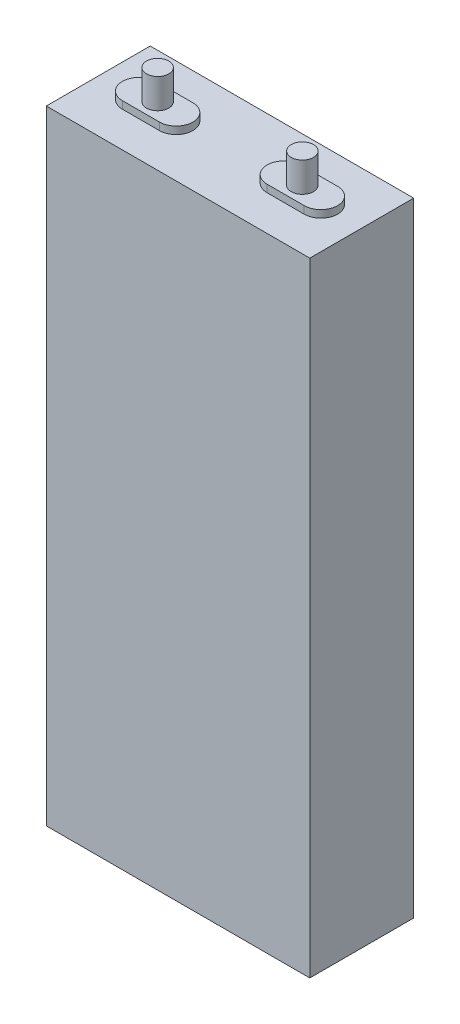
ISO-10303-21;
HEADER;
FILE_DESCRIPTION(('STEP AP214'),'2;1');
FILE_NAME('part.step','',(''),(''),'','','');
FILE_SCHEMA(('AUTOMOTIVE_DESIGN { 1 0 10303 214 1 1 1 1 }'));
ENDSEC;
DATA;
#1=APPLICATION_CONTEXT('core data for automotive mechanical design processes');
#2=APPLICATION_PROTOCOL_DEFINITION('international standard','automotive_design',2000,#1);
#3=PRODUCT_CONTEXT('',#1,'mechanical');
#4=PRODUCT('Part','Part','',(#3));
#5=PRODUCT_RELATED_PRODUCT_CATEGORY('part','',(#4));
#6=PRODUCT_DEFINITION_FORMATION('','',#4);
#7=PRODUCT_DEFINITION_CONTEXT('part definition',#1,'design');
#8=PRODUCT_DEFINITION('design','',#6,#7);
#9=PRODUCT_DEFINITION_SHAPE('','',#8);
#10=(LENGTH_UNIT() NAMED_UNIT(*) SI_UNIT(.MILLI.,.METRE.));
#11=(NAMED_UNIT(*) PLANE_ANGLE_UNIT() SI_UNIT($,.RADIAN.));
#12=(NAMED_UNIT(*) SI_UNIT($,.STERADIAN.) SOLID_ANGLE_UNIT());
#13=UNCERTAINTY_MEASURE_WITH_UNIT(LENGTH_MEASURE(1.E-05),#10,'distance_accuracy_value','');
#14=(GEOMETRIC_REPRESENTATION_CONTEXT(3) GLOBAL_UNCERTAINTY_ASSIGNED_CONTEXT((#13)) GLOBAL_UNIT_ASSIGNED_CONTEXT((#10,
#11,#12)) REPRESENTATION_CONTEXT('',''));
#15=CARTESIAN_POINT('',(0.,0.,0.));
#16=DIRECTION('',(0.,0.,1.));
#17=DIRECTION('',(1.,0.,0.));
#18=AXIS2_PLACEMENT_3D('',#15,#16,#17);
#19=CARTESIAN_POINT('',(0.,168.,0.));
#20=DIRECTION('',(0.,1.,0.));
#21=DIRECTION('',(0.,0.,1.));
#22=AXIS2_PLACEMENT_3D('',#19,#20,#21);
#23=PLANE('',#22);
#24=DIRECTION('',(0.,0.,1.));
#25=VECTOR('',#24,1.);
#26=CARTESIAN_POINT('',(-35.5,168.,-14.));
#27=LINE('',#26,#25);
#28=CARTESIAN_POINT('',(-35.5,168.,-14.));
#29=VERTEX_POINT('',#28);
#30=CARTESIAN_POINT('',(-35.5,168.,14.));
#31=VERTEX_POINT('',#30);
#32=EDGE_CURVE('E180',#29,#31,#27,.T.);
#33=ORIENTED_EDGE('',*,*,#32,.T.);
#34=DIRECTION('',(1.,0.,0.));
#35=VECTOR('',#34,1.);
#36=CARTESIAN_POINT('',(-35.5,168.,14.));
#37=LINE('',#36,#35);
#38=CARTESIAN_POINT('',(35.5,168.,14.));
#39=VERTEX_POINT('',#38);
#40=EDGE_CURVE('E183',#31,#39,#37,.T.);
#41=ORIENTED_EDGE('',*,*,#40,.T.);
#42=DIRECTION('',(0.,0.,-1.));
#43=VECTOR('',#42,1.);
#44=CARTESIAN_POINT('',(35.5,168.,-14.));
#45=LINE('',#44,#43);
#46=CARTESIAN_POINT('',(35.5,168.,-14.));
#47=VERTEX_POINT('',#46);
#48=EDGE_CURVE('E186',#39,#47,#45,.T.);
#49=ORIENTED_EDGE('',*,*,#48,.T.);
#50=DIRECTION('',(-1.,0.,0.));
#51=VECTOR('',#50,1.);
#52=CARTESIAN_POINT('',(-35.5,168.,-14.));
#53=LINE('',#52,#51);
#54=EDGE_CURVE('E188',#47,#29,#53,.T.);
#55=ORIENTED_EDGE('',*,*,#54,.T.);
#56=EDGE_LOOP('',(#33,#41,#49,#55));
#57=FACE_BOUND('',#56,.T.);
#58=DIRECTION('',(1.,0.,0.));
#59=VECTOR('',#58,1.);
#60=CARTESIAN_POINT('',(-24.5,168.,4.5));
#61=LINE('',#60,#59);
#62=CARTESIAN_POINT('',(-24.5,168.,4.5));
#63=VERTEX_POINT('',#62);
#64=CARTESIAN_POINT('',(-14.5,168.,4.5));
#65=VERTEX_POINT('',#64);
#66=EDGE_CURVE('E151',#63,#65,#61,.T.);
#67=ORIENTED_EDGE('',*,*,#66,.F.);
#68=CARTESIAN_POINT('',(-24.5,168.,0.));
#69=DIRECTION('',(0.,1.,0.));
#70=DIRECTION('',(0.,0.,1.));
#71=AXIS2_PLACEMENT_3D('',#68,#69,#70);
#72=CIRCLE('',#71,4.5);
#73=CARTESIAN_POINT('',(-24.5,168.,-4.5));
#74=VERTEX_POINT('',#73);
#75=EDGE_CURVE('E148',#74,#63,#72,.T.);
#76=ORIENTED_EDGE('',*,*,#75,.F.);
#77=DIRECTION('',(-1.,0.,0.));
#78=VECTOR('',#77,1.);
#79=CARTESIAN_POINT('',(-24.5,168.,-4.5));
#80=LINE('',#79,#78);
#81=CARTESIAN_POINT('',(-14.5,168.,-4.5));
#82=VERTEX_POINT('',#81);
#83=EDGE_CURVE('E160',#82,#74,#80,.T.);
#84=ORIENTED_EDGE('',*,*,#83,.F.);
#85=CARTESIAN_POINT('',(-14.5,168.,0.));
#86=DIRECTION('',(0.,1.,0.));
#87=DIRECTION('',(0.,0.,1.));
#88=AXIS2_PLACEMENT_3D('',#85,#86,#87);
#89=CIRCLE('',#88,4.5);
#90=EDGE_CURVE('E168',#65,#82,#89,.T.);
#91=ORIENTED_EDGE('',*,*,#90,.F.);
#92=EDGE_LOOP('',(#67,#76,#84,#91));
#93=FACE_BOUND('',#92,.T.);
#94=DIRECTION('',(-1.,0.,0.));
#95=VECTOR('',#94,1.);
#96=CARTESIAN_POINT('',(24.5,168.,-4.5));
#97=LINE('',#96,#95);
#98=CARTESIAN_POINT('',(24.5,168.,-4.5));
#99=VERTEX_POINT('',#98);
#100=CARTESIAN_POINT('',(14.5,168.,-4.5));
#101=VERTEX_POINT('',#100);
#102=EDGE_CURVE('E234',#99,#101,#97,.T.);
#103=ORIENTED_EDGE('',*,*,#102,.F.);
#104=CARTESIAN_POINT('',(24.5,168.,0.));
#105=DIRECTION('',(0.,1.,0.));
#106=DIRECTION('',(0.,0.,-1.));
#107=AXIS2_PLACEMENT_3D('',#104,#105,#106);
#108=CIRCLE('',#107,4.5);
#109=CARTESIAN_POINT('',(24.5,168.,4.5));
#110=VERTEX_POINT('',#109);
#111=EDGE_CURVE('E146',#110,#99,#108,.T.);
#112=ORIENTED_EDGE('',*,*,#111,.F.);
#113=DIRECTION('',(1.,0.,0.));
#114=VECTOR('',#113,1.);
#115=CARTESIAN_POINT('',(24.5,168.,4.5));
#116=LINE('',#115,#114);
#117=CARTESIAN_POINT('',(14.5,168.,4.5));
#118=VERTEX_POINT('',#117);
#119=EDGE_CURVE('E142',#118,#110,#116,.T.);
#120=ORIENTED_EDGE('',*,*,#119,.F.);
#121=CARTESIAN_POINT('',(14.5,168.,0.));
#122=DIRECTION('',(0.,1.,0.));
#123=DIRECTION('',(0.,0.,-1.));
#124=AXIS2_PLACEMENT_3D('',#121,#122,#123);
#125=CIRCLE('',#124,4.5);
#126=EDGE_CURVE('E236',#101,#118,#125,.T.);
#127=ORIENTED_EDGE('',*,*,#126,.F.);
#128=EDGE_LOOP('',(#103,#112,#120,#127));
#129=FACE_BOUND('',#128,.T.);
#130=ADVANCED_FACE('F33',(#57,#93,#129),#23,.T.);
#131=CARTESIAN_POINT('',(-35.5,168.,-14.));
#132=DIRECTION('',(1.,0.,0.));
#133=DIRECTION('',(0.,0.,-1.));
#134=AXIS2_PLACEMENT_3D('',#131,#132,#133);
#135=PLANE('',#134);
#136=DIRECTION('',(0.,0.,1.));
#137=VECTOR('',#136,1.);
#138=CARTESIAN_POINT('',(-35.5,0.,-14.));
#139=LINE('',#138,#137);
#140=CARTESIAN_POINT('',(-35.5,0.,-14.));
#141=VERTEX_POINT('',#140);
#142=CARTESIAN_POINT('',(-35.5,0.,14.));
#143=VERTEX_POINT('',#142);
#144=EDGE_CURVE('E179',#141,#143,#139,.T.);
#145=ORIENTED_EDGE('',*,*,#144,.T.);
#146=DIRECTION('',(0.,-1.,0.));
#147=VECTOR('',#146,1.);
#148=CARTESIAN_POINT('',(-35.5,168.,14.));
#149=LINE('',#148,#147);
#150=EDGE_CURVE('E41',#31,#143,#149,.T.);
#151=ORIENTED_EDGE('',*,*,#150,.F.);
#152=ORIENTED_EDGE('',*,*,#32,.F.);
#153=DIRECTION('',(0.,-1.,0.));
#154=VECTOR('',#153,1.);
#155=CARTESIAN_POINT('',(-35.5,168.,-14.));
#156=LINE('',#155,#154);
#157=EDGE_CURVE('E190',#29,#141,#156,.T.);
#158=ORIENTED_EDGE('',*,*,#157,.T.);
#159=EDGE_LOOP('',(#145,#151,#152,#158));
#160=FACE_BOUND('',#159,.T.);
#161=ADVANCED_FACE('F35',(#160),#135,.F.);
#162=CARTESIAN_POINT('',(-35.5,168.,14.));
#163=DIRECTION('',(0.,0.,-1.));
#164=DIRECTION('',(-1.,0.,0.));
#165=AXIS2_PLACEMENT_3D('',#162,#163,#164);
#166=PLANE('',#165);
#167=DIRECTION('',(1.,0.,0.));
#168=VECTOR('',#167,1.);
#169=CARTESIAN_POINT('',(-35.5,0.,14.));
#170=LINE('',#169,#168);
#171=CARTESIAN_POINT('',(35.5,0.,14.));
#172=VERTEX_POINT('',#171);
#173=EDGE_CURVE('E193',#143,#172,#170,.T.);
#174=ORIENTED_EDGE('',*,*,#173,.T.);
#175=DIRECTION('',(0.,-1.,0.));
#176=VECTOR('',#175,1.);
#177=CARTESIAN_POINT('',(35.5,168.,14.));
#178=LINE('',#177,#176);
#179=EDGE_CURVE('E203',#39,#172,#178,.T.);
#180=ORIENTED_EDGE('',*,*,#179,.F.);
#181=ORIENTED_EDGE('',*,*,#40,.F.);
#182=ORIENTED_EDGE('',*,*,#150,.T.);
#183=EDGE_LOOP('',(#174,#180,#181,#182));
#184=FACE_BOUND('',#183,.T.);
#185=ADVANCED_FACE('F208',(#184),#166,.F.);
#186=CARTESIAN_POINT('',(35.5,168.,-14.));
#187=DIRECTION('',(-1.,0.,0.));
#188=DIRECTION('',(0.,0.,1.));
#189=AXIS2_PLACEMENT_3D('',#186,#187,#188);
#190=PLANE('',#189);
#191=DIRECTION('',(0.,0.,-1.));
#192=VECTOR('',#191,1.);
#193=CARTESIAN_POINT('',(35.5,0.,-14.));
#194=LINE('',#193,#192);
#195=CARTESIAN_POINT('',(35.5,0.,-14.));
#196=VERTEX_POINT('',#195);
#197=EDGE_CURVE('E195',#172,#196,#194,.T.);
#198=ORIENTED_EDGE('',*,*,#197,.T.);
#199=DIRECTION('',(0.,-1.,0.));
#200=VECTOR('',#199,1.);
#201=CARTESIAN_POINT('',(35.5,168.,-14.));
#202=LINE('',#201,#200);
#203=EDGE_CURVE('E200',#47,#196,#202,.T.);
#204=ORIENTED_EDGE('',*,*,#203,.F.);
#205=ORIENTED_EDGE('',*,*,#48,.F.);
#206=ORIENTED_EDGE('',*,*,#179,.T.);
#207=EDGE_LOOP('',(#198,#204,#205,#206));
#208=FACE_BOUND('',#207,.T.);
#209=ADVANCED_FACE('F220',(#208),#190,.F.);
#210=CARTESIAN_POINT('',(-35.5,168.,-14.));
#211=DIRECTION('',(0.,0.,1.));
#212=DIRECTION('',(1.,0.,0.));
#213=AXIS2_PLACEMENT_3D('',#210,#211,#212);
#214=PLANE('',#213);
#215=DIRECTION('',(-1.,0.,0.));
#216=VECTOR('',#215,1.);
#217=CARTESIAN_POINT('',(-35.5,0.,-14.));
#218=LINE('',#217,#216);
#219=EDGE_CURVE('E184',#196,#141,#218,.T.);
#220=ORIENTED_EDGE('',*,*,#219,.T.);
#221=ORIENTED_EDGE('',*,*,#157,.F.);
#222=ORIENTED_EDGE('',*,*,#54,.F.);
#223=ORIENTED_EDGE('',*,*,#203,.T.);
#224=EDGE_LOOP('',(#220,#221,#222,#223));
#225=FACE_BOUND('',#224,.T.);
#226=ADVANCED_FACE('F224',(#225),#214,.F.);
#227=CARTESIAN_POINT('',(0.,0.,0.));
#228=DIRECTION('',(0.,1.,0.));
#229=DIRECTION('',(0.,0.,1.));
#230=AXIS2_PLACEMENT_3D('',#227,#228,#229);
#231=PLANE('',#230);
#232=ORIENTED_EDGE('',*,*,#144,.F.);
#233=ORIENTED_EDGE('',*,*,#219,.F.);
#234=ORIENTED_EDGE('',*,*,#197,.F.);
#235=ORIENTED_EDGE('',*,*,#173,.F.);
#236=EDGE_LOOP('',(#232,#233,#234,#235));
#237=FACE_BOUND('',#236,.T.);
#238=ADVANCED_FACE('F216',(#237),#231,.F.);
#239=CARTESIAN_POINT('',(-24.5,170.,0.));
#240=DIRECTION('',(0.,-1.,0.));
#241=DIRECTION('',(0.,0.,-1.));
#242=AXIS2_PLACEMENT_3D('',#239,#240,#241);
#243=CYLINDRICAL_SURFACE('',#242,4.5);
#244=ORIENTED_EDGE('',*,*,#75,.T.);
#245=DIRECTION('',(0.,-1.,0.));
#246=VECTOR('',#245,1.);
#247=CARTESIAN_POINT('',(-24.5,170.,4.5));
#248=LINE('',#247,#246);
#249=CARTESIAN_POINT('',(-24.5,170.,4.5));
#250=VERTEX_POINT('',#249);
#251=EDGE_CURVE('E177',#250,#63,#248,.T.);
#252=ORIENTED_EDGE('',*,*,#251,.F.);
#253=CARTESIAN_POINT('',(-24.5,170.,0.));
#254=DIRECTION('',(0.,1.,0.));
#255=DIRECTION('',(0.,0.,1.));
#256=AXIS2_PLACEMENT_3D('',#253,#254,#255);
#257=CIRCLE('',#256,4.5);
#258=CARTESIAN_POINT('',(-24.5,170.,-4.5));
#259=VERTEX_POINT('',#258);
#260=EDGE_CURVE('E156',#259,#250,#257,.T.);
#261=ORIENTED_EDGE('',*,*,#260,.F.);
#262=DIRECTION('',(0.,-1.,0.));
#263=VECTOR('',#262,1.);
#264=CARTESIAN_POINT('',(-24.5,170.,-4.5));
#265=LINE('',#264,#263);
#266=EDGE_CURVE('E165',#259,#74,#265,.T.);
#267=ORIENTED_EDGE('',*,*,#266,.T.);
#268=EDGE_LOOP('',(#244,#252,#261,#267));
#269=FACE_BOUND('',#268,.T.);
#270=ADVANCED_FACE('F300',(#269),#243,.T.);
#271=CARTESIAN_POINT('',(-24.5,170.,4.5));
#272=DIRECTION('',(0.,0.,-1.));
#273=DIRECTION('',(-1.,0.,0.));
#274=AXIS2_PLACEMENT_3D('',#271,#272,#273);
#275=PLANE('',#274);
#276=ORIENTED_EDGE('',*,*,#66,.T.);
#277=DIRECTION('',(0.,-1.,0.));
#278=VECTOR('',#277,1.);
#279=CARTESIAN_POINT('',(-14.5,170.,4.5));
#280=LINE('',#279,#278);
#281=CARTESIAN_POINT('',(-14.5,170.,4.5));
#282=VERTEX_POINT('',#281);
#283=EDGE_CURVE('E174',#282,#65,#280,.T.);
#284=ORIENTED_EDGE('',*,*,#283,.F.);
#285=DIRECTION('',(1.,0.,0.));
#286=VECTOR('',#285,1.);
#287=CARTESIAN_POINT('',(-24.5,170.,4.5));
#288=LINE('',#287,#286);
#289=EDGE_CURVE('E159',#250,#282,#288,.T.);
#290=ORIENTED_EDGE('',*,*,#289,.F.);
#291=ORIENTED_EDGE('',*,*,#251,.T.);
#292=EDGE_LOOP('',(#276,#284,#290,#291));
#293=FACE_BOUND('',#292,.T.);
#294=ADVANCED_FACE('F296',(#293),#275,.F.);
#295=CARTESIAN_POINT('',(-14.5,170.,0.));
#296=DIRECTION('',(0.,-1.,0.));
#297=DIRECTION('',(0.,0.,-1.));
#298=AXIS2_PLACEMENT_3D('',#295,#296,#297);
#299=CYLINDRICAL_SURFACE('',#298,4.5);
#300=ORIENTED_EDGE('',*,*,#90,.T.);
#301=DIRECTION('',(0.,-1.,0.));
#302=VECTOR('',#301,1.);
#303=CARTESIAN_POINT('',(-14.5,170.,-4.5));
#304=LINE('',#303,#302);
#305=CARTESIAN_POINT('',(-14.5,170.,-4.5));
#306=VERTEX_POINT('',#305);
#307=EDGE_CURVE('E56',#306,#82,#304,.T.);
#308=ORIENTED_EDGE('',*,*,#307,.F.);
#309=CARTESIAN_POINT('',(-14.5,170.,0.));
#310=DIRECTION('',(0.,1.,0.));
#311=DIRECTION('',(0.,0.,1.));
#312=AXIS2_PLACEMENT_3D('',#309,#310,#311);
#313=CIRCLE('',#312,4.5);
#314=EDGE_CURVE('E162',#282,#306,#313,.T.);
#315=ORIENTED_EDGE('',*,*,#314,.F.);
#316=ORIENTED_EDGE('',*,*,#283,.T.);
#317=EDGE_LOOP('',(#300,#308,#315,#316));
#318=FACE_BOUND('',#317,.T.);
#319=ADVANCED_FACE('F293',(#318),#299,.T.);
#320=CARTESIAN_POINT('',(-24.5,170.,-4.5));
#321=DIRECTION('',(0.,0.,1.));
#322=DIRECTION('',(1.,0.,0.));
#323=AXIS2_PLACEMENT_3D('',#320,#321,#322);
#324=PLANE('',#323);
#325=ORIENTED_EDGE('',*,*,#83,.T.);
#326=ORIENTED_EDGE('',*,*,#266,.F.);
#327=DIRECTION('',(-1.,0.,0.));
#328=VECTOR('',#327,1.);
#329=CARTESIAN_POINT('',(-24.5,170.,-4.5));
#330=LINE('',#329,#328);
#331=EDGE_CURVE('E164',#306,#259,#330,.T.);
#332=ORIENTED_EDGE('',*,*,#331,.F.);
#333=ORIENTED_EDGE('',*,*,#307,.T.);
#334=EDGE_LOOP('',(#325,#326,#332,#333));
#335=FACE_BOUND('',#334,.T.);
#336=ADVANCED_FACE('F289',(#335),#324,.F.);
#337=CARTESIAN_POINT('',(-24.5,170.,0.));
#338=DIRECTION('',(0.,1.,0.));
#339=DIRECTION('',(0.,0.,1.));
#340=AXIS2_PLACEMENT_3D('',#337,#338,#339);
#341=PLANE('',#340);
#342=CARTESIAN_POINT('',(-19.5,170.,0.));
#343=DIRECTION('',(0.,1.,0.));
#344=DIRECTION('',(0.,0.,1.));
#345=AXIS2_PLACEMENT_3D('',#342,#343,#344);
#346=CIRCLE('',#345,3.);
#347=CARTESIAN_POINT('',(-19.5,170.,3.));
#348=VERTEX_POINT('',#347);
#349=EDGE_CURVE('E247',#348,#348,#346,.T.);
#350=ORIENTED_EDGE('',*,*,#349,.F.);
#351=EDGE_LOOP('',(#350));
#352=FACE_BOUND('',#351,.T.);
#353=ORIENTED_EDGE('',*,*,#260,.T.);
#354=ORIENTED_EDGE('',*,*,#289,.T.);
#355=ORIENTED_EDGE('',*,*,#314,.T.);
#356=ORIENTED_EDGE('',*,*,#331,.T.);
#357=EDGE_LOOP('',(#353,#354,#355,#356));
#358=FACE_BOUND('',#357,.T.);
#359=ADVANCED_FACE('F286',(#352,#358),#341,.T.);
#360=CARTESIAN_POINT('',(24.5,170.,0.));
#361=DIRECTION('',(0.,-1.,0.));
#362=DIRECTION('',(0.,0.,-1.));
#363=AXIS2_PLACEMENT_3D('',#360,#361,#362);
#364=CYLINDRICAL_SURFACE('',#363,4.5);
#365=ORIENTED_EDGE('',*,*,#111,.T.);
#366=DIRECTION('',(0.,-1.,0.));
#367=VECTOR('',#366,1.);
#368=CARTESIAN_POINT('',(24.5,170.,-4.5));
#369=LINE('',#368,#367);
#370=CARTESIAN_POINT('',(24.5,170.,-4.5));
#371=VERTEX_POINT('',#370);
#372=EDGE_CURVE('E127',#371,#99,#369,.T.);
#373=ORIENTED_EDGE('',*,*,#372,.F.);
#374=CARTESIAN_POINT('',(24.5,170.,0.));
#375=DIRECTION('',(0.,1.,0.));
#376=DIRECTION('',(0.,0.,-1.));
#377=AXIS2_PLACEMENT_3D('',#374,#375,#376);
#378=CIRCLE('',#377,4.5);
#379=CARTESIAN_POINT('',(24.5,170.,4.5));
#380=VERTEX_POINT('',#379);
#381=EDGE_CURVE('E134',#380,#371,#378,.T.);
#382=ORIENTED_EDGE('',*,*,#381,.F.);
#383=DIRECTION('',(0.,-1.,0.));
#384=VECTOR('',#383,1.);
#385=CARTESIAN_POINT('',(24.5,170.,4.5));
#386=LINE('',#385,#384);
#387=EDGE_CURVE('E244',#380,#110,#386,.T.);
#388=ORIENTED_EDGE('',*,*,#387,.T.);
#389=EDGE_LOOP('',(#365,#373,#382,#388));
#390=FACE_BOUND('',#389,.T.);
#391=ADVANCED_FACE('F144',(#390),#364,.T.);
#392=CARTESIAN_POINT('',(24.5,170.,-4.5));
#393=DIRECTION('',(0.,0.,1.));
#394=DIRECTION('',(1.,0.,0.));
#395=AXIS2_PLACEMENT_3D('',#392,#393,#394);
#396=PLANE('',#395);
#397=ORIENTED_EDGE('',*,*,#102,.T.);
#398=DIRECTION('',(0.,-1.,0.));
#399=VECTOR('',#398,1.);
#400=CARTESIAN_POINT('',(14.5,170.,-4.5));
#401=LINE('',#400,#399);
#402=CARTESIAN_POINT('',(14.5,170.,-4.5));
#403=VERTEX_POINT('',#402);
#404=EDGE_CURVE('E130',#403,#101,#401,.T.);
#405=ORIENTED_EDGE('',*,*,#404,.F.);
#406=DIRECTION('',(-1.,0.,0.));
#407=VECTOR('',#406,1.);
#408=CARTESIAN_POINT('',(24.5,170.,-4.5));
#409=LINE('',#408,#407);
#410=EDGE_CURVE('E123',#371,#403,#409,.T.);
#411=ORIENTED_EDGE('',*,*,#410,.F.);
#412=ORIENTED_EDGE('',*,*,#372,.T.);
#413=EDGE_LOOP('',(#397,#405,#411,#412));
#414=FACE_BOUND('',#413,.T.);
#415=ADVANCED_FACE('F125',(#414),#396,.F.);
#416=CARTESIAN_POINT('',(14.5,170.,0.));
#417=DIRECTION('',(0.,-1.,0.));
#418=DIRECTION('',(0.,0.,-1.));
#419=AXIS2_PLACEMENT_3D('',#416,#417,#418);
#420=CYLINDRICAL_SURFACE('',#419,4.5);
#421=ORIENTED_EDGE('',*,*,#126,.T.);
#422=DIRECTION('',(0.,-1.,0.));
#423=VECTOR('',#422,1.);
#424=CARTESIAN_POINT('',(14.5,170.,4.5));
#425=LINE('',#424,#423);
#426=CARTESIAN_POINT('',(14.5,170.,4.5));
#427=VERTEX_POINT('',#426);
#428=EDGE_CURVE('E48',#427,#118,#425,.T.);
#429=ORIENTED_EDGE('',*,*,#428,.F.);
#430=CARTESIAN_POINT('',(14.5,170.,0.));
#431=DIRECTION('',(0.,1.,0.));
#432=DIRECTION('',(0.,0.,-1.));
#433=AXIS2_PLACEMENT_3D('',#430,#431,#432);
#434=CIRCLE('',#433,4.5);
#435=EDGE_CURVE('E133',#403,#427,#434,.T.);
#436=ORIENTED_EDGE('',*,*,#435,.F.);
#437=ORIENTED_EDGE('',*,*,#404,.T.);
#438=EDGE_LOOP('',(#421,#429,#436,#437));
#439=FACE_BOUND('',#438,.T.);
#440=ADVANCED_FACE('F275',(#439),#420,.T.);
#441=CARTESIAN_POINT('',(24.5,170.,4.5));
#442=DIRECTION('',(0.,0.,-1.));
#443=DIRECTION('',(-1.,0.,0.));
#444=AXIS2_PLACEMENT_3D('',#441,#442,#443);
#445=PLANE('',#444);
#446=ORIENTED_EDGE('',*,*,#119,.T.);
#447=ORIENTED_EDGE('',*,*,#387,.F.);
#448=DIRECTION('',(1.,0.,0.));
#449=VECTOR('',#448,1.);
#450=CARTESIAN_POINT('',(24.5,170.,4.5));
#451=LINE('',#450,#449);
#452=EDGE_CURVE('E138',#427,#380,#451,.T.);
#453=ORIENTED_EDGE('',*,*,#452,.F.);
#454=ORIENTED_EDGE('',*,*,#428,.T.);
#455=EDGE_LOOP('',(#446,#447,#453,#454));
#456=FACE_BOUND('',#455,.T.);
#457=ADVANCED_FACE('F267',(#456),#445,.F.);
#458=CARTESIAN_POINT('',(24.5,170.,0.));
#459=DIRECTION('',(0.,-1.,0.));
#460=DIRECTION('',(0.,0.,-1.));
#461=AXIS2_PLACEMENT_3D('',#458,#459,#460);
#462=PLANE('',#461);
#463=CARTESIAN_POINT('',(19.5,170.,0.));
#464=DIRECTION('',(0.,-1.,0.));
#465=DIRECTION('',(0.,0.,-1.));
#466=AXIS2_PLACEMENT_3D('',#463,#464,#465);
#467=CIRCLE('',#466,3.);
#468=CARTESIAN_POINT('',(19.5,170.,-3.));
#469=VERTEX_POINT('',#468);
#470=EDGE_CURVE('E11',#469,#469,#467,.F.);
#471=ORIENTED_EDGE('',*,*,#470,.F.);
#472=EDGE_LOOP('',(#471));
#473=FACE_BOUND('',#472,.T.);
#474=ORIENTED_EDGE('',*,*,#381,.T.);
#475=ORIENTED_EDGE('',*,*,#410,.T.);
#476=ORIENTED_EDGE('',*,*,#435,.T.);
#477=ORIENTED_EDGE('',*,*,#452,.T.);
#478=EDGE_LOOP('',(#474,#475,#476,#477));
#479=FACE_BOUND('',#478,.T.);
#480=ADVANCED_FACE('F137',(#473,#479),#462,.F.);
#481=CARTESIAN_POINT('',(-19.5,178.,0.));
#482=DIRECTION('',(0.,-1.,0.));
#483=DIRECTION('',(0.,0.,-1.));
#484=AXIS2_PLACEMENT_3D('',#481,#482,#483);
#485=CYLINDRICAL_SURFACE('',#484,3.);
#486=CARTESIAN_POINT('',(-19.5,178.,0.));
#487=DIRECTION('',(0.,1.,0.));
#488=DIRECTION('',(0.,0.,1.));
#489=AXIS2_PLACEMENT_3D('',#486,#487,#488);
#490=CIRCLE('',#489,3.);
#491=CARTESIAN_POINT('',(-19.5,178.,3.));
#492=VERTEX_POINT('',#491);
#493=EDGE_CURVE('E239',#492,#492,#490,.T.);
#494=ORIENTED_EDGE('',*,*,#493,.F.);
#495=EDGE_LOOP('',(#494));
#496=FACE_BOUND('',#495,.T.);
#497=ORIENTED_EDGE('',*,*,#349,.T.);
#498=EDGE_LOOP('',(#497));
#499=FACE_BOUND('',#498,.T.);
#500=ADVANCED_FACE('F266',(#496,#499),#485,.T.);
#501=CARTESIAN_POINT('',(-19.5,178.,0.));
#502=DIRECTION('',(0.,1.,0.));
#503=DIRECTION('',(0.,0.,1.));
#504=AXIS2_PLACEMENT_3D('',#501,#502,#503);
#505=PLANE('',#504);
#506=ORIENTED_EDGE('',*,*,#493,.T.);
#507=EDGE_LOOP('',(#506));
#508=FACE_BOUND('',#507,.T.);
#509=ADVANCED_FACE('F261',(#508),#505,.T.);
#510=CARTESIAN_POINT('',(19.5,178.,0.));
#511=DIRECTION('',(0.,-1.,0.));
#512=DIRECTION('',(0.,0.,-1.));
#513=AXIS2_PLACEMENT_3D('',#510,#511,#512);
#514=CYLINDRICAL_SURFACE('',#513,3.);
#515=CARTESIAN_POINT('',(19.5,178.,0.));
#516=DIRECTION('',(0.,1.,0.));
#517=DIRECTION('',(0.,0.,-1.));
#518=AXIS2_PLACEMENT_3D('',#515,#516,#517);
#519=CIRCLE('',#518,3.);
#520=CARTESIAN_POINT('',(19.5,178.,-3.));
#521=VERTEX_POINT('',#520);
#522=EDGE_CURVE('E250',#521,#521,#519,.T.);
#523=ORIENTED_EDGE('',*,*,#522,.F.);
#524=EDGE_LOOP('',(#523));
#525=FACE_BOUND('',#524,.T.);
#526=ORIENTED_EDGE('',*,*,#470,.T.);
#527=EDGE_LOOP('',(#526));
#528=FACE_BOUND('',#527,.T.);
#529=ADVANCED_FACE('F258',(#525,#528),#514,.T.);
#530=CARTESIAN_POINT('',(19.5,178.,0.));
#531=DIRECTION('',(0.,-1.,0.));
#532=DIRECTION('',(0.,0.,-1.));
#533=AXIS2_PLACEMENT_3D('',#530,#531,#532);
#534=PLANE('',#533);
#535=ORIENTED_EDGE('',*,*,#522,.T.);
#536=EDGE_LOOP('',(#535));
#537=FACE_BOUND('',#536,.T.);
#538=ADVANCED_FACE('F256',(#537),#534,.F.);
#539=CLOSED_SHELL('',(#130,#161,#185,#209,#226,#238,#270,#294,#319,#336,#359,#391,#415,#440,
#457,#480,#500,#509,#529,#538));
#540=MANIFOLD_SOLID_BREP('B2',#539);
#541=ADVANCED_BREP_SHAPE_REPRESENTATION('',(#18,#540),#14);
#542=SHAPE_DEFINITION_REPRESENTATION(#9,#541);
ENDSEC;
END-ISO-10303-21;
